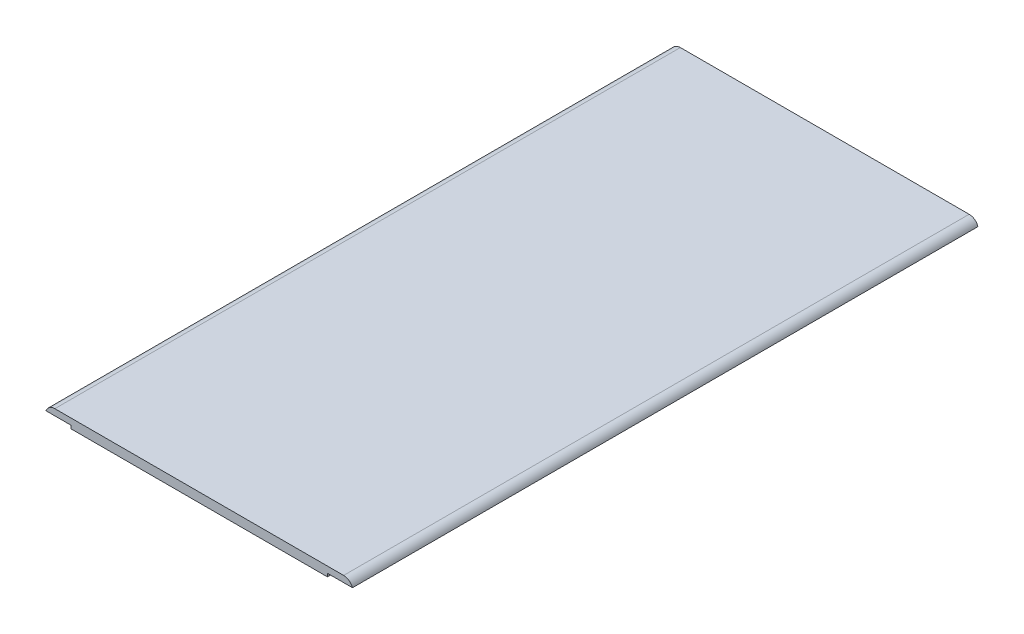
ISO-10303-21;
HEADER;
FILE_DESCRIPTION(('STEP AP214'),'2;1');
FILE_NAME('part.step','',(''),(''),'','','');
FILE_SCHEMA(('AUTOMOTIVE_DESIGN { 1 0 10303 214 1 1 1 1 }'));
ENDSEC;
DATA;
#1=APPLICATION_CONTEXT('core data for automotive mechanical design processes');
#2=APPLICATION_PROTOCOL_DEFINITION('international standard','automotive_design',2000,#1);
#3=PRODUCT_CONTEXT('',#1,'mechanical');
#4=PRODUCT('Part','Part','',(#3));
#5=PRODUCT_RELATED_PRODUCT_CATEGORY('part','',(#4));
#6=PRODUCT_DEFINITION_FORMATION('','',#4);
#7=PRODUCT_DEFINITION_CONTEXT('part definition',#1,'design');
#8=PRODUCT_DEFINITION('design','',#6,#7);
#9=PRODUCT_DEFINITION_SHAPE('','',#8);
#10=(LENGTH_UNIT() NAMED_UNIT(*) SI_UNIT(.MILLI.,.METRE.));
#11=(NAMED_UNIT(*) PLANE_ANGLE_UNIT() SI_UNIT($,.RADIAN.));
#12=(NAMED_UNIT(*) SI_UNIT($,.STERADIAN.) SOLID_ANGLE_UNIT());
#13=UNCERTAINTY_MEASURE_WITH_UNIT(LENGTH_MEASURE(1.E-05),#10,'distance_accuracy_value','');
#14=(GEOMETRIC_REPRESENTATION_CONTEXT(3) GLOBAL_UNCERTAINTY_ASSIGNED_CONTEXT((#13)) GLOBAL_UNIT_ASSIGNED_CONTEXT((#10,
#11,#12)) REPRESENTATION_CONTEXT('',''));
#15=CARTESIAN_POINT('',(0.,0.,0.));
#16=DIRECTION('',(0.,0.,1.));
#17=DIRECTION('',(1.,0.,0.));
#18=AXIS2_PLACEMENT_3D('',#15,#16,#17);
#19=CARTESIAN_POINT('',(-49.,1.5,100.));
#20=DIRECTION('',(0.,0.,-1.));
#21=DIRECTION('',(-1.,0.,0.));
#22=AXIS2_PLACEMENT_3D('',#19,#20,#21);
#23=PLANE('',#22);
#24=DIRECTION('',(1.,0.,0.));
#25=VECTOR('',#24,1.);
#26=CARTESIAN_POINT('',(-49.,1.5,100.));
#27=LINE('',#26,#25);
#28=CARTESIAN_POINT('',(-46.1715728752538,1.5,100.));
#29=VERTEX_POINT('',#28);
#30=CARTESIAN_POINT('',(46.1715728752538,1.5,100.));
#31=VERTEX_POINT('',#30);
#32=EDGE_CURVE('E281',#29,#31,#27,.T.);
#33=ORIENTED_EDGE('',*,*,#32,.F.);
#34=CARTESIAN_POINT('',(-46.1715728752538,-1.5,100.));
#35=DIRECTION('',(0.,0.,-1.));
#36=DIRECTION('',(-1.,0.,0.));
#37=AXIS2_PLACEMENT_3D('',#34,#35,#36);
#38=CIRCLE('',#37,3.);
#39=CARTESIAN_POINT('',(-49.,-0.5,100.));
#40=VERTEX_POINT('',#39);
#41=EDGE_CURVE('E170',#29,#40,#38,.F.);
#42=ORIENTED_EDGE('',*,*,#41,.T.);
#43=DIRECTION('',(-1.,0.,0.));
#44=VECTOR('',#43,1.);
#45=CARTESIAN_POINT('',(-49.,-0.5,100.));
#46=LINE('',#45,#44);
#47=CARTESIAN_POINT('',(-41.,-0.5,100.));
#48=VERTEX_POINT('',#47);
#49=EDGE_CURVE('E270',#48,#40,#46,.T.);
#50=ORIENTED_EDGE('',*,*,#49,.F.);
#51=DIRECTION('',(0.,-1.,0.));
#52=VECTOR('',#51,1.);
#53=CARTESIAN_POINT('',(-41.,-0.5,100.));
#54=LINE('',#53,#52);
#55=CARTESIAN_POINT('',(-41.,-1.5,100.));
#56=VERTEX_POINT('',#55);
#57=EDGE_CURVE('E275',#48,#56,#54,.T.);
#58=ORIENTED_EDGE('',*,*,#57,.T.);
#59=DIRECTION('',(1.,0.,0.));
#60=VECTOR('',#59,1.);
#61=CARTESIAN_POINT('',(-49.,-1.5,100.));
#62=LINE('',#61,#60);
#63=CARTESIAN_POINT('',(41.,-1.5,100.));
#64=VERTEX_POINT('',#63);
#65=EDGE_CURVE('E278',#56,#64,#62,.T.);
#66=ORIENTED_EDGE('',*,*,#65,.T.);
#67=DIRECTION('',(0.,-1.,0.));
#68=VECTOR('',#67,1.);
#69=CARTESIAN_POINT('',(41.,-0.5,100.));
#70=LINE('',#69,#68);
#71=CARTESIAN_POINT('',(41.,-0.5,100.));
#72=VERTEX_POINT('',#71);
#73=EDGE_CURVE('E163',#72,#64,#70,.T.);
#74=ORIENTED_EDGE('',*,*,#73,.F.);
#75=DIRECTION('',(-1.,0.,0.));
#76=VECTOR('',#75,1.);
#77=CARTESIAN_POINT('',(49.,-0.5,100.));
#78=LINE('',#77,#76);
#79=CARTESIAN_POINT('',(49.,-0.5,100.));
#80=VERTEX_POINT('',#79);
#81=EDGE_CURVE('E150',#80,#72,#78,.T.);
#82=ORIENTED_EDGE('',*,*,#81,.F.);
#83=CARTESIAN_POINT('',(46.1715728752538,-1.5,100.));
#84=DIRECTION('',(0.,0.,-1.));
#85=DIRECTION('',(-1.,0.,0.));
#86=AXIS2_PLACEMENT_3D('',#83,#84,#85);
#87=CIRCLE('',#86,3.);
#88=EDGE_CURVE('E160',#80,#31,#87,.F.);
#89=ORIENTED_EDGE('',*,*,#88,.T.);
#90=EDGE_LOOP('',(#33,#42,#50,#58,#66,#74,#82,#89));
#91=FACE_BOUND('',#90,.T.);
#92=ADVANCED_FACE('F33',(#91),#23,.F.);
#93=CARTESIAN_POINT('',(-49.,1.5,-100.));
#94=DIRECTION('',(0.,0.,1.));
#95=DIRECTION('',(1.,0.,0.));
#96=AXIS2_PLACEMENT_3D('',#93,#94,#95);
#97=PLANE('',#96);
#98=DIRECTION('',(1.,0.,0.));
#99=VECTOR('',#98,1.);
#100=CARTESIAN_POINT('',(-49.,-0.5,-100.));
#101=LINE('',#100,#99);
#102=CARTESIAN_POINT('',(-49.,-0.5,-100.));
#103=VERTEX_POINT('',#102);
#104=CARTESIAN_POINT('',(-41.,-0.5,-100.));
#105=VERTEX_POINT('',#104);
#106=EDGE_CURVE('E264',#103,#105,#101,.T.);
#107=ORIENTED_EDGE('',*,*,#106,.F.);
#108=CARTESIAN_POINT('',(-46.1715728752538,-1.5,-100.));
#109=DIRECTION('',(0.,0.,1.));
#110=DIRECTION('',(1.,0.,0.));
#111=AXIS2_PLACEMENT_3D('',#108,#109,#110);
#112=CIRCLE('',#111,3.);
#113=CARTESIAN_POINT('',(-46.1715728752538,1.5,-100.));
#114=VERTEX_POINT('',#113);
#115=EDGE_CURVE('E180',#103,#114,#112,.F.);
#116=ORIENTED_EDGE('',*,*,#115,.T.);
#117=DIRECTION('',(-1.,0.,0.));
#118=VECTOR('',#117,1.);
#119=CARTESIAN_POINT('',(-49.,1.5,-100.));
#120=LINE('',#119,#118);
#121=CARTESIAN_POINT('',(46.1715728752538,1.5,-100.));
#122=VERTEX_POINT('',#121);
#123=EDGE_CURVE('E283',#122,#114,#120,.T.);
#124=ORIENTED_EDGE('',*,*,#123,.F.);
#125=CARTESIAN_POINT('',(46.1715728752538,-1.5,-100.));
#126=DIRECTION('',(0.,0.,1.));
#127=DIRECTION('',(1.,0.,0.));
#128=AXIS2_PLACEMENT_3D('',#125,#126,#127);
#129=CIRCLE('',#128,3.);
#130=CARTESIAN_POINT('',(49.,-0.5,-100.));
#131=VERTEX_POINT('',#130);
#132=EDGE_CURVE('E173',#122,#131,#129,.F.);
#133=ORIENTED_EDGE('',*,*,#132,.T.);
#134=DIRECTION('',(1.,0.,0.));
#135=VECTOR('',#134,1.);
#136=CARTESIAN_POINT('',(49.,-0.5,-100.));
#137=LINE('',#136,#135);
#138=CARTESIAN_POINT('',(41.,-0.5,-100.));
#139=VERTEX_POINT('',#138);
#140=EDGE_CURVE('E153',#139,#131,#137,.T.);
#141=ORIENTED_EDGE('',*,*,#140,.F.);
#142=DIRECTION('',(0.,-1.,0.));
#143=VECTOR('',#142,1.);
#144=CARTESIAN_POINT('',(41.,-0.5,-100.));
#145=LINE('',#144,#143);
#146=CARTESIAN_POINT('',(41.,-1.5,-100.));
#147=VERTEX_POINT('',#146);
#148=EDGE_CURVE('E257',#139,#147,#145,.T.);
#149=ORIENTED_EDGE('',*,*,#148,.T.);
#150=DIRECTION('',(-1.,0.,0.));
#151=VECTOR('',#150,1.);
#152=CARTESIAN_POINT('',(-49.,-1.5,-100.));
#153=LINE('',#152,#151);
#154=CARTESIAN_POINT('',(-41.,-1.5,-100.));
#155=VERTEX_POINT('',#154);
#156=EDGE_CURVE('E284',#147,#155,#153,.T.);
#157=ORIENTED_EDGE('',*,*,#156,.T.);
#158=DIRECTION('',(0.,-1.,0.));
#159=VECTOR('',#158,1.);
#160=CARTESIAN_POINT('',(-41.,-0.5,-100.));
#161=LINE('',#160,#159);
#162=EDGE_CURVE('E273',#105,#155,#161,.T.);
#163=ORIENTED_EDGE('',*,*,#162,.F.);
#164=EDGE_LOOP('',(#107,#116,#124,#133,#141,#149,#157,#163));
#165=FACE_BOUND('',#164,.T.);
#166=ADVANCED_FACE('F294',(#165),#97,.F.);
#167=CARTESIAN_POINT('',(0.,1.5,0.));
#168=DIRECTION('',(0.,1.,0.));
#169=DIRECTION('',(0.,0.,1.));
#170=AXIS2_PLACEMENT_3D('',#167,#168,#169);
#171=PLANE('',#170);
#172=ORIENTED_EDGE('',*,*,#123,.T.);
#173=DIRECTION('',(0.,0.,1.));
#174=VECTOR('',#173,1.);
#175=CARTESIAN_POINT('',(-46.1715728752538,1.5,100.));
#176=LINE('',#175,#174);
#177=EDGE_CURVE('E171',#114,#29,#176,.T.);
#178=ORIENTED_EDGE('',*,*,#177,.T.);
#179=ORIENTED_EDGE('',*,*,#32,.T.);
#180=DIRECTION('',(0.,0.,1.));
#181=VECTOR('',#180,1.);
#182=CARTESIAN_POINT('',(46.1715728752538,1.5,-100.));
#183=LINE('',#182,#181);
#184=EDGE_CURVE('E169',#31,#122,#183,.F.);
#185=ORIENTED_EDGE('',*,*,#184,.T.);
#186=EDGE_LOOP('',(#172,#178,#179,#185));
#187=FACE_BOUND('',#186,.T.);
#188=ADVANCED_FACE('F290',(#187),#171,.T.);
#189=CARTESIAN_POINT('',(0.,-1.5,0.));
#190=DIRECTION('',(0.,1.,0.));
#191=DIRECTION('',(0.,0.,1.));
#192=AXIS2_PLACEMENT_3D('',#189,#190,#191);
#193=PLANE('',#192);
#194=DIRECTION('',(1.,0.,0.));
#195=VECTOR('',#194,1.);
#196=CARTESIAN_POINT('',(-12.5,-1.5,-95.75));
#197=LINE('',#196,#195);
#198=CARTESIAN_POINT('',(-7.5,-1.5,-95.75));
#199=VERTEX_POINT('',#198);
#200=CARTESIAN_POINT('',(7.5,-1.5,-95.75));
#201=VERTEX_POINT('',#200);
#202=EDGE_CURVE('E216',#199,#201,#197,.T.);
#203=ORIENTED_EDGE('',*,*,#202,.F.);
#204=CARTESIAN_POINT('',(-7.5,-1.5,-90.75));
#205=DIRECTION('',(0.,1.,0.));
#206=DIRECTION('',(0.,0.,1.));
#207=AXIS2_PLACEMENT_3D('',#204,#205,#206);
#208=CIRCLE('',#207,5.);
#209=CARTESIAN_POINT('',(-12.5,-1.5,-90.75));
#210=VERTEX_POINT('',#209);
#211=EDGE_CURVE('E41',#199,#210,#208,.T.);
#212=ORIENTED_EDGE('',*,*,#211,.T.);
#213=DIRECTION('',(0.,0.,-1.));
#214=VECTOR('',#213,1.);
#215=CARTESIAN_POINT('',(-12.5,-1.5,-65.75));
#216=LINE('',#215,#214);
#217=CARTESIAN_POINT('',(-12.5,-1.5,-70.75));
#218=VERTEX_POINT('',#217);
#219=EDGE_CURVE('E227',#218,#210,#216,.T.);
#220=ORIENTED_EDGE('',*,*,#219,.F.);
#221=CARTESIAN_POINT('',(-7.5,-1.5,-70.75));
#222=DIRECTION('',(0.,1.,0.));
#223=DIRECTION('',(0.,0.,1.));
#224=AXIS2_PLACEMENT_3D('',#221,#222,#223);
#225=CIRCLE('',#224,5.);
#226=CARTESIAN_POINT('',(-7.5,-1.5,-65.75));
#227=VERTEX_POINT('',#226);
#228=EDGE_CURVE('E11',#218,#227,#225,.T.);
#229=ORIENTED_EDGE('',*,*,#228,.T.);
#230=DIRECTION('',(-1.,0.,0.));
#231=VECTOR('',#230,1.);
#232=CARTESIAN_POINT('',(-12.5,-1.5,-65.75));
#233=LINE('',#232,#231);
#234=CARTESIAN_POINT('',(7.5,-1.5,-65.75));
#235=VERTEX_POINT('',#234);
#236=EDGE_CURVE('E251',#235,#227,#233,.T.);
#237=ORIENTED_EDGE('',*,*,#236,.F.);
#238=CARTESIAN_POINT('',(7.5,-1.5,-70.75));
#239=DIRECTION('',(0.,1.,0.));
#240=DIRECTION('',(0.,0.,1.));
#241=AXIS2_PLACEMENT_3D('',#238,#239,#240);
#242=CIRCLE('',#241,5.);
#243=CARTESIAN_POINT('',(12.5,-1.5,-70.75));
#244=VERTEX_POINT('',#243);
#245=EDGE_CURVE('E209',#235,#244,#242,.T.);
#246=ORIENTED_EDGE('',*,*,#245,.T.);
#247=DIRECTION('',(0.,0.,1.));
#248=VECTOR('',#247,1.);
#249=CARTESIAN_POINT('',(12.5,-1.5,-65.75));
#250=LINE('',#249,#248);
#251=CARTESIAN_POINT('',(12.5,-1.5,-90.75));
#252=VERTEX_POINT('',#251);
#253=EDGE_CURVE('E218',#252,#244,#250,.T.);
#254=ORIENTED_EDGE('',*,*,#253,.F.);
#255=CARTESIAN_POINT('',(7.5,-1.5,-90.75));
#256=DIRECTION('',(0.,1.,0.));
#257=DIRECTION('',(0.,0.,1.));
#258=AXIS2_PLACEMENT_3D('',#255,#256,#257);
#259=CIRCLE('',#258,5.);
#260=EDGE_CURVE('E211',#252,#201,#259,.T.);
#261=ORIENTED_EDGE('',*,*,#260,.T.);
#262=EDGE_LOOP('',(#203,#212,#220,#229,#237,#246,#254,#261));
#263=FACE_BOUND('',#262,.T.);
#264=ORIENTED_EDGE('',*,*,#156,.F.);
#265=DIRECTION('',(0.,0.,-1.));
#266=VECTOR('',#265,1.);
#267=CARTESIAN_POINT('',(41.,-1.5,100.));
#268=LINE('',#267,#266);
#269=EDGE_CURVE('E156',#64,#147,#268,.T.);
#270=ORIENTED_EDGE('',*,*,#269,.F.);
#271=ORIENTED_EDGE('',*,*,#65,.F.);
#272=DIRECTION('',(0.,0.,1.));
#273=VECTOR('',#272,1.);
#274=CARTESIAN_POINT('',(-41.,-1.5,100.));
#275=LINE('',#274,#273);
#276=EDGE_CURVE('E260',#155,#56,#275,.T.);
#277=ORIENTED_EDGE('',*,*,#276,.F.);
#278=EDGE_LOOP('',(#264,#270,#271,#277));
#279=FACE_BOUND('',#278,.T.);
#280=ADVANCED_FACE('F214',(#263,#279),#193,.F.);
#281=CARTESIAN_POINT('',(-41.,-0.5,100.));
#282=DIRECTION('',(1.,0.,0.));
#283=DIRECTION('',(0.,0.,-1.));
#284=AXIS2_PLACEMENT_3D('',#281,#282,#283);
#285=PLANE('',#284);
#286=ORIENTED_EDGE('',*,*,#276,.T.);
#287=ORIENTED_EDGE('',*,*,#57,.F.);
#288=DIRECTION('',(0.,0.,1.));
#289=VECTOR('',#288,1.);
#290=CARTESIAN_POINT('',(-41.,-0.5,100.));
#291=LINE('',#290,#289);
#292=EDGE_CURVE('E267',#105,#48,#291,.T.);
#293=ORIENTED_EDGE('',*,*,#292,.F.);
#294=ORIENTED_EDGE('',*,*,#162,.T.);
#295=EDGE_LOOP('',(#286,#287,#293,#294));
#296=FACE_BOUND('',#295,.T.);
#297=ADVANCED_FACE('F304',(#296),#285,.F.);
#298=CARTESIAN_POINT('',(0.,-0.5,0.));
#299=DIRECTION('',(0.,-1.,0.));
#300=DIRECTION('',(0.,0.,-1.));
#301=AXIS2_PLACEMENT_3D('',#298,#299,#300);
#302=PLANE('',#301);
#303=DIRECTION('',(0.,0.,-1.));
#304=VECTOR('',#303,1.);
#305=CARTESIAN_POINT('',(-49.,-0.5,100.));
#306=LINE('',#305,#304);
#307=EDGE_CURVE('E262',#40,#103,#306,.T.);
#308=ORIENTED_EDGE('',*,*,#307,.T.);
#309=ORIENTED_EDGE('',*,*,#106,.T.);
#310=ORIENTED_EDGE('',*,*,#292,.T.);
#311=ORIENTED_EDGE('',*,*,#49,.T.);
#312=EDGE_LOOP('',(#308,#309,#310,#311));
#313=FACE_BOUND('',#312,.T.);
#314=ADVANCED_FACE('F302',(#313),#302,.T.);
#315=CARTESIAN_POINT('',(41.,-0.5,100.));
#316=DIRECTION('',(-1.,0.,0.));
#317=DIRECTION('',(0.,0.,1.));
#318=AXIS2_PLACEMENT_3D('',#315,#316,#317);
#319=PLANE('',#318);
#320=ORIENTED_EDGE('',*,*,#269,.T.);
#321=ORIENTED_EDGE('',*,*,#148,.F.);
#322=DIRECTION('',(0.,0.,-1.));
#323=VECTOR('',#322,1.);
#324=CARTESIAN_POINT('',(41.,-0.5,100.));
#325=LINE('',#324,#323);
#326=EDGE_CURVE('E164',#72,#139,#325,.T.);
#327=ORIENTED_EDGE('',*,*,#326,.F.);
#328=ORIENTED_EDGE('',*,*,#73,.T.);
#329=EDGE_LOOP('',(#320,#321,#327,#328));
#330=FACE_BOUND('',#329,.T.);
#331=ADVANCED_FACE('F310',(#330),#319,.F.);
#332=CARTESIAN_POINT('',(0.,-0.5,0.));
#333=DIRECTION('',(0.,1.,0.));
#334=DIRECTION('',(0.,0.,1.));
#335=AXIS2_PLACEMENT_3D('',#332,#333,#334);
#336=PLANE('',#335);
#337=DIRECTION('',(0.,0.,1.));
#338=VECTOR('',#337,1.);
#339=CARTESIAN_POINT('',(49.,-0.5,100.));
#340=LINE('',#339,#338);
#341=EDGE_CURVE('E146',#131,#80,#340,.T.);
#342=ORIENTED_EDGE('',*,*,#341,.T.);
#343=ORIENTED_EDGE('',*,*,#81,.T.);
#344=ORIENTED_EDGE('',*,*,#326,.T.);
#345=ORIENTED_EDGE('',*,*,#140,.T.);
#346=EDGE_LOOP('',(#342,#343,#344,#345));
#347=FACE_BOUND('',#346,.T.);
#348=ADVANCED_FACE('F148',(#347),#336,.F.);
#349=CARTESIAN_POINT('',(-46.1715728752538,-1.5,-100.));
#350=DIRECTION('',(0.,0.,-1.));
#351=DIRECTION('',(-1.,0.,0.));
#352=AXIS2_PLACEMENT_3D('',#349,#350,#351);
#353=CYLINDRICAL_SURFACE('',#352,3.);
#354=ORIENTED_EDGE('',*,*,#115,.F.);
#355=ORIENTED_EDGE('',*,*,#307,.F.);
#356=ORIENTED_EDGE('',*,*,#41,.F.);
#357=ORIENTED_EDGE('',*,*,#177,.F.);
#358=EDGE_LOOP('',(#354,#355,#356,#357));
#359=FACE_BOUND('',#358,.T.);
#360=ADVANCED_FACE('F299',(#359),#353,.T.);
#361=CARTESIAN_POINT('',(46.1715728752538,-1.5,-100.));
#362=DIRECTION('',(0.,0.,-1.));
#363=DIRECTION('',(-1.,0.,0.));
#364=AXIS2_PLACEMENT_3D('',#361,#362,#363);
#365=CYLINDRICAL_SURFACE('',#364,3.);
#366=ORIENTED_EDGE('',*,*,#88,.F.);
#367=ORIENTED_EDGE('',*,*,#341,.F.);
#368=ORIENTED_EDGE('',*,*,#132,.F.);
#369=ORIENTED_EDGE('',*,*,#184,.F.);
#370=EDGE_LOOP('',(#366,#367,#368,#369));
#371=FACE_BOUND('',#370,.T.);
#372=ADVANCED_FACE('F167',(#371),#365,.T.);
#373=CARTESIAN_POINT('',(-12.5,1.,-65.75));
#374=DIRECTION('',(-1.,0.,0.));
#375=DIRECTION('',(0.,0.,1.));
#376=AXIS2_PLACEMENT_3D('',#373,#374,#375);
#377=PLANE('',#376);
#378=ORIENTED_EDGE('',*,*,#219,.T.);
#379=DIRECTION('',(0.,-1.,0.));
#380=VECTOR('',#379,1.);
#381=CARTESIAN_POINT('',(-12.5,1.,-90.75));
#382=LINE('',#381,#380);
#383=CARTESIAN_POINT('',(-12.5,1.,-90.75));
#384=VERTEX_POINT('',#383);
#385=EDGE_CURVE('E207',#210,#384,#382,.F.);
#386=ORIENTED_EDGE('',*,*,#385,.T.);
#387=DIRECTION('',(0.,0.,-1.));
#388=VECTOR('',#387,1.);
#389=CARTESIAN_POINT('',(-12.5,1.,-65.75));
#390=LINE('',#389,#388);
#391=CARTESIAN_POINT('',(-12.5,1.,-70.75));
#392=VERTEX_POINT('',#391);
#393=EDGE_CURVE('E245',#392,#384,#390,.T.);
#394=ORIENTED_EDGE('',*,*,#393,.F.);
#395=DIRECTION('',(0.,-1.,0.));
#396=VECTOR('',#395,1.);
#397=CARTESIAN_POINT('',(-12.5,-1.5,-70.75));
#398=LINE('',#397,#396);
#399=EDGE_CURVE('E205',#392,#218,#398,.T.);
#400=ORIENTED_EDGE('',*,*,#399,.T.);
#401=EDGE_LOOP('',(#378,#386,#394,#400));
#402=FACE_BOUND('',#401,.T.);
#403=ADVANCED_FACE('F331',(#402),#377,.F.);
#404=CARTESIAN_POINT('',(-12.5,1.,-65.75));
#405=DIRECTION('',(0.,0.,1.));
#406=DIRECTION('',(1.,0.,0.));
#407=AXIS2_PLACEMENT_3D('',#404,#405,#406);
#408=PLANE('',#407);
#409=DIRECTION('',(-1.,0.,0.));
#410=VECTOR('',#409,1.);
#411=CARTESIAN_POINT('',(-12.5,1.,-65.75));
#412=LINE('',#411,#410);
#413=CARTESIAN_POINT('',(7.5,1.,-65.75));
#414=VERTEX_POINT('',#413);
#415=CARTESIAN_POINT('',(-7.5,1.,-65.75));
#416=VERTEX_POINT('',#415);
#417=EDGE_CURVE('E241',#414,#416,#412,.T.);
#418=ORIENTED_EDGE('',*,*,#417,.F.);
#419=DIRECTION('',(0.,-1.,0.));
#420=VECTOR('',#419,1.);
#421=CARTESIAN_POINT('',(7.5,-1.5,-65.75));
#422=LINE('',#421,#420);
#423=EDGE_CURVE('E184',#414,#235,#422,.T.);
#424=ORIENTED_EDGE('',*,*,#423,.T.);
#425=ORIENTED_EDGE('',*,*,#236,.T.);
#426=DIRECTION('',(0.,-1.,0.));
#427=VECTOR('',#426,1.);
#428=CARTESIAN_POINT('',(-7.5,1.,-65.75));
#429=LINE('',#428,#427);
#430=EDGE_CURVE('E182',#227,#416,#429,.F.);
#431=ORIENTED_EDGE('',*,*,#430,.T.);
#432=EDGE_LOOP('',(#418,#424,#425,#431));
#433=FACE_BOUND('',#432,.T.);
#434=ADVANCED_FACE('F351',(#433),#408,.F.);
#435=CARTESIAN_POINT('',(12.5,1.,-65.75));
#436=DIRECTION('',(1.,0.,0.));
#437=DIRECTION('',(0.,0.,-1.));
#438=AXIS2_PLACEMENT_3D('',#435,#436,#437);
#439=PLANE('',#438);
#440=ORIENTED_EDGE('',*,*,#253,.T.);
#441=DIRECTION('',(0.,-1.,0.));
#442=VECTOR('',#441,1.);
#443=CARTESIAN_POINT('',(12.5,1.,-70.75));
#444=LINE('',#443,#442);
#445=CARTESIAN_POINT('',(12.5,1.,-70.75));
#446=VERTEX_POINT('',#445);
#447=EDGE_CURVE('E190',#244,#446,#444,.F.);
#448=ORIENTED_EDGE('',*,*,#447,.T.);
#449=DIRECTION('',(0.,0.,1.));
#450=VECTOR('',#449,1.);
#451=CARTESIAN_POINT('',(12.5,1.,-65.75));
#452=LINE('',#451,#450);
#453=CARTESIAN_POINT('',(12.5,1.,-90.75));
#454=VERTEX_POINT('',#453);
#455=EDGE_CURVE('E235',#454,#446,#452,.T.);
#456=ORIENTED_EDGE('',*,*,#455,.F.);
#457=DIRECTION('',(0.,-1.,0.));
#458=VECTOR('',#457,1.);
#459=CARTESIAN_POINT('',(12.5,-1.5,-90.75));
#460=LINE('',#459,#458);
#461=EDGE_CURVE('E187',#454,#252,#460,.T.);
#462=ORIENTED_EDGE('',*,*,#461,.T.);
#463=EDGE_LOOP('',(#440,#448,#456,#462));
#464=FACE_BOUND('',#463,.T.);
#465=ADVANCED_FACE('F239',(#464),#439,.F.);
#466=CARTESIAN_POINT('',(-12.5,1.,-95.75));
#467=DIRECTION('',(0.,0.,-1.));
#468=DIRECTION('',(-1.,0.,0.));
#469=AXIS2_PLACEMENT_3D('',#466,#467,#468);
#470=PLANE('',#469);
#471=ORIENTED_EDGE('',*,*,#202,.T.);
#472=DIRECTION('',(0.,-1.,0.));
#473=VECTOR('',#472,1.);
#474=CARTESIAN_POINT('',(7.5,1.,-95.75));
#475=LINE('',#474,#473);
#476=CARTESIAN_POINT('',(7.5,1.,-95.75));
#477=VERTEX_POINT('',#476);
#478=EDGE_CURVE('E203',#201,#477,#475,.F.);
#479=ORIENTED_EDGE('',*,*,#478,.T.);
#480=DIRECTION('',(1.,0.,0.));
#481=VECTOR('',#480,1.);
#482=CARTESIAN_POINT('',(-12.5,1.,-95.75));
#483=LINE('',#482,#481);
#484=CARTESIAN_POINT('',(-7.5,1.,-95.75));
#485=VERTEX_POINT('',#484);
#486=EDGE_CURVE('E237',#485,#477,#483,.T.);
#487=ORIENTED_EDGE('',*,*,#486,.F.);
#488=DIRECTION('',(0.,-1.,0.));
#489=VECTOR('',#488,1.);
#490=CARTESIAN_POINT('',(-7.5,-1.5,-95.75));
#491=LINE('',#490,#489);
#492=EDGE_CURVE('E200',#485,#199,#491,.T.);
#493=ORIENTED_EDGE('',*,*,#492,.T.);
#494=EDGE_LOOP('',(#471,#479,#487,#493));
#495=FACE_BOUND('',#494,.T.);
#496=ADVANCED_FACE('F223',(#495),#470,.F.);
#497=CARTESIAN_POINT('',(0.,1.,0.));
#498=DIRECTION('',(0.,-1.,0.));
#499=DIRECTION('',(0.,0.,-1.));
#500=AXIS2_PLACEMENT_3D('',#497,#498,#499);
#501=PLANE('',#500);
#502=ORIENTED_EDGE('',*,*,#455,.T.);
#503=CARTESIAN_POINT('',(7.5,1.,-70.75));
#504=DIRECTION('',(0.,-1.,0.));
#505=DIRECTION('',(0.,0.,-1.));
#506=AXIS2_PLACEMENT_3D('',#503,#504,#505);
#507=CIRCLE('',#506,5.);
#508=EDGE_CURVE('E198',#446,#414,#507,.T.);
#509=ORIENTED_EDGE('',*,*,#508,.T.);
#510=ORIENTED_EDGE('',*,*,#417,.T.);
#511=CARTESIAN_POINT('',(-7.5,1.,-70.75));
#512=DIRECTION('',(0.,-1.,0.));
#513=DIRECTION('',(0.,0.,-1.));
#514=AXIS2_PLACEMENT_3D('',#511,#512,#513);
#515=CIRCLE('',#514,5.);
#516=EDGE_CURVE('E192',#416,#392,#515,.T.);
#517=ORIENTED_EDGE('',*,*,#516,.T.);
#518=ORIENTED_EDGE('',*,*,#393,.T.);
#519=CARTESIAN_POINT('',(-7.5,1.,-90.75));
#520=DIRECTION('',(0.,-1.,0.));
#521=DIRECTION('',(0.,0.,-1.));
#522=AXIS2_PLACEMENT_3D('',#519,#520,#521);
#523=CIRCLE('',#522,5.);
#524=EDGE_CURVE('E194',#384,#485,#523,.T.);
#525=ORIENTED_EDGE('',*,*,#524,.T.);
#526=ORIENTED_EDGE('',*,*,#486,.T.);
#527=CARTESIAN_POINT('',(7.5,1.,-90.75));
#528=DIRECTION('',(0.,-1.,0.));
#529=DIRECTION('',(0.,0.,-1.));
#530=AXIS2_PLACEMENT_3D('',#527,#528,#529);
#531=CIRCLE('',#530,5.);
#532=EDGE_CURVE('E196',#477,#454,#531,.T.);
#533=ORIENTED_EDGE('',*,*,#532,.T.);
#534=EDGE_LOOP('',(#502,#509,#510,#517,#518,#525,#526,#533));
#535=FACE_BOUND('',#534,.T.);
#536=ADVANCED_FACE('F234',(#535),#501,.T.);
#537=CARTESIAN_POINT('',(7.5,1.,-70.75));
#538=DIRECTION('',(0.,1.,0.));
#539=DIRECTION('',(0.,0.,1.));
#540=AXIS2_PLACEMENT_3D('',#537,#538,#539);
#541=CYLINDRICAL_SURFACE('',#540,5.);
#542=ORIENTED_EDGE('',*,*,#508,.F.);
#543=ORIENTED_EDGE('',*,*,#447,.F.);
#544=ORIENTED_EDGE('',*,*,#245,.F.);
#545=ORIENTED_EDGE('',*,*,#423,.F.);
#546=EDGE_LOOP('',(#542,#543,#544,#545));
#547=FACE_BOUND('',#546,.T.);
#548=ADVANCED_FACE('F332',(#547),#541,.F.);
#549=CARTESIAN_POINT('',(7.5,1.,-90.75));
#550=DIRECTION('',(0.,1.,0.));
#551=DIRECTION('',(0.,0.,1.));
#552=AXIS2_PLACEMENT_3D('',#549,#550,#551);
#553=CYLINDRICAL_SURFACE('',#552,5.);
#554=ORIENTED_EDGE('',*,*,#532,.F.);
#555=ORIENTED_EDGE('',*,*,#478,.F.);
#556=ORIENTED_EDGE('',*,*,#260,.F.);
#557=ORIENTED_EDGE('',*,*,#461,.F.);
#558=EDGE_LOOP('',(#554,#555,#556,#557));
#559=FACE_BOUND('',#558,.T.);
#560=ADVANCED_FACE('F230',(#559),#553,.F.);
#561=CARTESIAN_POINT('',(-7.5,1.,-90.75));
#562=DIRECTION('',(0.,1.,0.));
#563=DIRECTION('',(0.,0.,1.));
#564=AXIS2_PLACEMENT_3D('',#561,#562,#563);
#565=CYLINDRICAL_SURFACE('',#564,5.);
#566=ORIENTED_EDGE('',*,*,#524,.F.);
#567=ORIENTED_EDGE('',*,*,#385,.F.);
#568=ORIENTED_EDGE('',*,*,#211,.F.);
#569=ORIENTED_EDGE('',*,*,#492,.F.);
#570=EDGE_LOOP('',(#566,#567,#568,#569));
#571=FACE_BOUND('',#570,.T.);
#572=ADVANCED_FACE('F337',(#571),#565,.F.);
#573=CARTESIAN_POINT('',(-7.5,1.,-70.75));
#574=DIRECTION('',(0.,1.,0.));
#575=DIRECTION('',(0.,0.,1.));
#576=AXIS2_PLACEMENT_3D('',#573,#574,#575);
#577=CYLINDRICAL_SURFACE('',#576,5.);
#578=ORIENTED_EDGE('',*,*,#516,.F.);
#579=ORIENTED_EDGE('',*,*,#430,.F.);
#580=ORIENTED_EDGE('',*,*,#228,.F.);
#581=ORIENTED_EDGE('',*,*,#399,.F.);
#582=EDGE_LOOP('',(#578,#579,#580,#581));
#583=FACE_BOUND('',#582,.T.);
#584=ADVANCED_FACE('F35',(#583),#577,.F.);
#585=CLOSED_SHELL('',(#92,#166,#188,#280,#297,#314,#331,#348,#360,#372,#403,#434,#465,#496,#536,
#548,#560,#572,#584));
#586=MANIFOLD_SOLID_BREP('B2',#585);
#587=ADVANCED_BREP_SHAPE_REPRESENTATION('',(#18,#586),#14);
#588=SHAPE_DEFINITION_REPRESENTATION(#9,#587);
ENDSEC;
END-ISO-10303-21;
